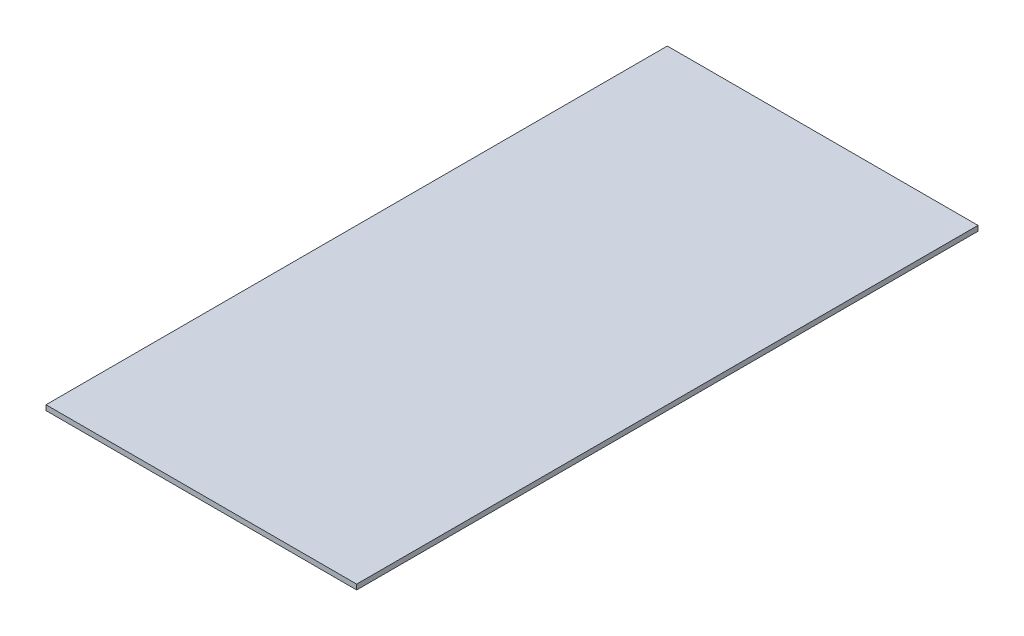
ISO-10303-21;
HEADER;
FILE_DESCRIPTION(('STEP AP214'),'2;1');
FILE_NAME('part.step','',(''),(''),'','','');
FILE_SCHEMA(('AUTOMOTIVE_DESIGN { 1 0 10303 214 1 1 1 1 }'));
ENDSEC;
DATA;
#1=APPLICATION_CONTEXT('core data for automotive mechanical design processes');
#2=APPLICATION_PROTOCOL_DEFINITION('international standard','automotive_design',2000,#1);
#3=PRODUCT_CONTEXT('',#1,'mechanical');
#4=PRODUCT('Part','Part','',(#3));
#5=PRODUCT_RELATED_PRODUCT_CATEGORY('part','',(#4));
#6=PRODUCT_DEFINITION_FORMATION('','',#4);
#7=PRODUCT_DEFINITION_CONTEXT('part definition',#1,'design');
#8=PRODUCT_DEFINITION('design','',#6,#7);
#9=PRODUCT_DEFINITION_SHAPE('','',#8);
#10=(LENGTH_UNIT() NAMED_UNIT(*) SI_UNIT(.MILLI.,.METRE.));
#11=(NAMED_UNIT(*) PLANE_ANGLE_UNIT() SI_UNIT($,.RADIAN.));
#12=(NAMED_UNIT(*) SI_UNIT($,.STERADIAN.) SOLID_ANGLE_UNIT());
#13=UNCERTAINTY_MEASURE_WITH_UNIT(LENGTH_MEASURE(1.E-05),#10,'distance_accuracy_value','');
#14=(GEOMETRIC_REPRESENTATION_CONTEXT(3) GLOBAL_UNCERTAINTY_ASSIGNED_CONTEXT((#13)) GLOBAL_UNIT_ASSIGNED_CONTEXT((#10,
#11,#12)) REPRESENTATION_CONTEXT('',''));
#15=CARTESIAN_POINT('',(0.,0.,0.));
#16=DIRECTION('',(0.,0.,1.));
#17=DIRECTION('',(1.,0.,0.));
#18=AXIS2_PLACEMENT_3D('',#15,#16,#17);
#19=CARTESIAN_POINT('',(-582.030150753769,10.,-629.001005025126));
#20=DIRECTION('',(1.,0.,0.));
#21=DIRECTION('',(0.,0.,-1.));
#22=AXIS2_PLACEMENT_3D('',#19,#20,#21);
#23=PLANE('',#22);
#24=DIRECTION('',(0.,0.,1.));
#25=VECTOR('',#24,1.);
#26=CARTESIAN_POINT('',(-582.030150753769,0.,-629.001005025126));
#27=LINE('',#26,#25);
#28=CARTESIAN_POINT('',(-582.030150753769,0.,-629.001005025126));
#29=VERTEX_POINT('',#28);
#30=CARTESIAN_POINT('',(-582.030150753769,0.,590.198994974874));
#31=VERTEX_POINT('',#30);
#32=EDGE_CURVE('E98',#29,#31,#27,.T.);
#33=ORIENTED_EDGE('',*,*,#32,.T.);
#34=DIRECTION('',(0.,-1.,0.));
#35=VECTOR('',#34,1.);
#36=CARTESIAN_POINT('',(-582.030150753769,10.,590.198994974874));
#37=LINE('',#36,#35);
#38=CARTESIAN_POINT('',(-582.030150753769,10.,590.198994974874));
#39=VERTEX_POINT('',#38);
#40=EDGE_CURVE('E11',#39,#31,#37,.T.);
#41=ORIENTED_EDGE('',*,*,#40,.F.);
#42=DIRECTION('',(0.,0.,1.));
#43=VECTOR('',#42,1.);
#44=CARTESIAN_POINT('',(-582.030150753769,10.,-629.001005025126));
#45=LINE('',#44,#43);
#46=CARTESIAN_POINT('',(-582.030150753769,10.,-629.001005025126));
#47=VERTEX_POINT('',#46);
#48=EDGE_CURVE('E86',#47,#39,#45,.T.);
#49=ORIENTED_EDGE('',*,*,#48,.F.);
#50=DIRECTION('',(0.,-1.,0.));
#51=VECTOR('',#50,1.);
#52=CARTESIAN_POINT('',(-582.030150753769,10.,-629.001005025126));
#53=LINE('',#52,#51);
#54=EDGE_CURVE('E94',#47,#29,#53,.T.);
#55=ORIENTED_EDGE('',*,*,#54,.T.);
#56=EDGE_LOOP('',(#33,#41,#49,#55));
#57=FACE_BOUND('',#56,.T.);
#58=ADVANCED_FACE('F35',(#57),#23,.F.);
#59=CARTESIAN_POINT('',(-582.030150753769,10.,590.198994974874));
#60=DIRECTION('',(0.,0.,-1.));
#61=DIRECTION('',(-1.,0.,0.));
#62=AXIS2_PLACEMENT_3D('',#59,#60,#61);
#63=PLANE('',#62);
#64=DIRECTION('',(1.,0.,0.));
#65=VECTOR('',#64,1.);
#66=CARTESIAN_POINT('',(-582.030150753769,0.,590.198994974874));
#67=LINE('',#66,#65);
#68=CARTESIAN_POINT('',(27.5698492462314,0.,590.198994974874));
#69=VERTEX_POINT('',#68);
#70=EDGE_CURVE('E90',#31,#69,#67,.T.);
#71=ORIENTED_EDGE('',*,*,#70,.T.);
#72=DIRECTION('',(0.,-1.,0.));
#73=VECTOR('',#72,1.);
#74=CARTESIAN_POINT('',(27.5698492462314,10.,590.198994974874));
#75=LINE('',#74,#73);
#76=CARTESIAN_POINT('',(27.5698492462314,10.,590.198994974874));
#77=VERTEX_POINT('',#76);
#78=EDGE_CURVE('E43',#77,#69,#75,.T.);
#79=ORIENTED_EDGE('',*,*,#78,.F.);
#80=DIRECTION('',(1.,0.,0.));
#81=VECTOR('',#80,1.);
#82=CARTESIAN_POINT('',(-582.030150753769,10.,590.198994974874));
#83=LINE('',#82,#81);
#84=EDGE_CURVE('E81',#39,#77,#83,.T.);
#85=ORIENTED_EDGE('',*,*,#84,.F.);
#86=ORIENTED_EDGE('',*,*,#40,.T.);
#87=EDGE_LOOP('',(#71,#79,#85,#86));
#88=FACE_BOUND('',#87,.T.);
#89=ADVANCED_FACE('F89',(#88),#63,.F.);
#90=CARTESIAN_POINT('',(27.5698492462312,10.,-629.001005025126));
#91=DIRECTION('',(-1.,0.,0.));
#92=DIRECTION('',(0.,0.,1.));
#93=AXIS2_PLACEMENT_3D('',#90,#91,#92);
#94=PLANE('',#93);
#95=DIRECTION('',(0.,0.,-1.));
#96=VECTOR('',#95,1.);
#97=CARTESIAN_POINT('',(27.5698492462312,0.,-629.001005025126));
#98=LINE('',#97,#96);
#99=CARTESIAN_POINT('',(27.5698492462312,0.,-629.001005025126));
#100=VERTEX_POINT('',#99);
#101=EDGE_CURVE('E68',#69,#100,#98,.T.);
#102=ORIENTED_EDGE('',*,*,#101,.T.);
#103=DIRECTION('',(0.,-1.,0.));
#104=VECTOR('',#103,1.);
#105=CARTESIAN_POINT('',(27.5698492462312,10.,-629.001005025126));
#106=LINE('',#105,#104);
#107=CARTESIAN_POINT('',(27.5698492462312,10.,-629.001005025126));
#108=VERTEX_POINT('',#107);
#109=EDGE_CURVE('E91',#108,#100,#106,.T.);
#110=ORIENTED_EDGE('',*,*,#109,.F.);
#111=DIRECTION('',(0.,0.,-1.));
#112=VECTOR('',#111,1.);
#113=CARTESIAN_POINT('',(27.5698492462312,10.,-629.001005025126));
#114=LINE('',#113,#112);
#115=EDGE_CURVE('E84',#77,#108,#114,.T.);
#116=ORIENTED_EDGE('',*,*,#115,.F.);
#117=ORIENTED_EDGE('',*,*,#78,.T.);
#118=EDGE_LOOP('',(#102,#110,#116,#117));
#119=FACE_BOUND('',#118,.T.);
#120=ADVANCED_FACE('F92',(#119),#94,.F.);
#121=CARTESIAN_POINT('',(-582.030150753769,10.,-629.001005025126));
#122=DIRECTION('',(0.,0.,1.));
#123=DIRECTION('',(1.,0.,0.));
#124=AXIS2_PLACEMENT_3D('',#121,#122,#123);
#125=PLANE('',#124);
#126=DIRECTION('',(-1.,0.,0.));
#127=VECTOR('',#126,1.);
#128=CARTESIAN_POINT('',(-582.030150753769,0.,-629.001005025126));
#129=LINE('',#128,#127);
#130=EDGE_CURVE('E74',#100,#29,#129,.T.);
#131=ORIENTED_EDGE('',*,*,#130,.T.);
#132=ORIENTED_EDGE('',*,*,#54,.F.);
#133=DIRECTION('',(-1.,0.,0.));
#134=VECTOR('',#133,1.);
#135=CARTESIAN_POINT('',(-582.030150753769,10.,-629.001005025126));
#136=LINE('',#135,#134);
#137=EDGE_CURVE('E51',#108,#47,#136,.T.);
#138=ORIENTED_EDGE('',*,*,#137,.F.);
#139=ORIENTED_EDGE('',*,*,#109,.T.);
#140=EDGE_LOOP('',(#131,#132,#138,#139));
#141=FACE_BOUND('',#140,.T.);
#142=ADVANCED_FACE('F105',(#141),#125,.F.);
#143=CARTESIAN_POINT('',(0.,10.,0.));
#144=DIRECTION('',(0.,1.,0.));
#145=DIRECTION('',(0.,0.,1.));
#146=AXIS2_PLACEMENT_3D('',#143,#144,#145);
#147=PLANE('',#146);
#148=ORIENTED_EDGE('',*,*,#48,.T.);
#149=ORIENTED_EDGE('',*,*,#84,.T.);
#150=ORIENTED_EDGE('',*,*,#115,.T.);
#151=ORIENTED_EDGE('',*,*,#137,.T.);
#152=EDGE_LOOP('',(#148,#149,#150,#151));
#153=FACE_BOUND('',#152,.T.);
#154=ADVANCED_FACE('F82',(#153),#147,.T.);
#155=CARTESIAN_POINT('',(0.,0.,0.));
#156=DIRECTION('',(0.,1.,0.));
#157=DIRECTION('',(0.,0.,1.));
#158=AXIS2_PLACEMENT_3D('',#155,#156,#157);
#159=PLANE('',#158);
#160=ORIENTED_EDGE('',*,*,#32,.F.);
#161=ORIENTED_EDGE('',*,*,#130,.F.);
#162=ORIENTED_EDGE('',*,*,#101,.F.);
#163=ORIENTED_EDGE('',*,*,#70,.F.);
#164=EDGE_LOOP('',(#160,#161,#162,#163));
#165=FACE_BOUND('',#164,.T.);
#166=ADVANCED_FACE('F108',(#165),#159,.F.);
#167=CLOSED_SHELL('',(#58,#89,#120,#142,#154,#166));
#168=MANIFOLD_SOLID_BREP('B2',#167);
#169=ADVANCED_BREP_SHAPE_REPRESENTATION('',(#18,#168),#14);
#170=SHAPE_DEFINITION_REPRESENTATION(#9,#169);
ENDSEC;
END-ISO-10303-21;
